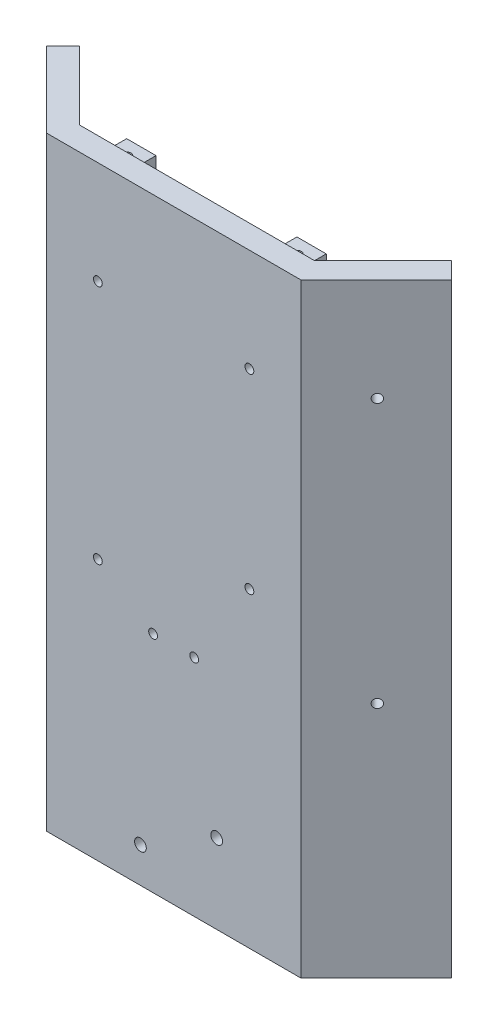
ISO-10303-21;
HEADER;
FILE_DESCRIPTION(('STEP AP214'),'2;1');
FILE_NAME('part.step','',(''),(''),'','','');
FILE_SCHEMA(('AUTOMOTIVE_DESIGN { 1 0 10303 214 1 1 1 1 }'));
ENDSEC;
DATA;
#1=APPLICATION_CONTEXT('core data for automotive mechanical design processes');
#2=APPLICATION_PROTOCOL_DEFINITION('international standard','automotive_design',2000,#1);
#3=PRODUCT_CONTEXT('',#1,'mechanical');
#4=PRODUCT('Part','Part','',(#3));
#5=PRODUCT_RELATED_PRODUCT_CATEGORY('part','',(#4));
#6=PRODUCT_DEFINITION_FORMATION('','',#4);
#7=PRODUCT_DEFINITION_CONTEXT('part definition',#1,'design');
#8=PRODUCT_DEFINITION('design','',#6,#7);
#9=PRODUCT_DEFINITION_SHAPE('','',#8);
#10=(LENGTH_UNIT() NAMED_UNIT(*) SI_UNIT(.MILLI.,.METRE.));
#11=(NAMED_UNIT(*) PLANE_ANGLE_UNIT() SI_UNIT($,.RADIAN.));
#12=(NAMED_UNIT(*) SI_UNIT($,.STERADIAN.) SOLID_ANGLE_UNIT());
#13=UNCERTAINTY_MEASURE_WITH_UNIT(LENGTH_MEASURE(1.E-05),#10,'distance_accuracy_value','');
#14=(GEOMETRIC_REPRESENTATION_CONTEXT(3) GLOBAL_UNCERTAINTY_ASSIGNED_CONTEXT((#13)) GLOBAL_UNIT_ASSIGNED_CONTEXT((#10,
#11,#12)) REPRESENTATION_CONTEXT('',''));
#15=CARTESIAN_POINT('',(0.,0.,0.));
#16=DIRECTION('',(0.,0.,1.));
#17=DIRECTION('',(1.,0.,0.));
#18=AXIS2_PLACEMENT_3D('',#15,#16,#17);
#19=CARTESIAN_POINT('',(-40.,206.,0.));
#20=DIRECTION('',(0.,0.,1.));
#21=DIRECTION('',(1.,0.,0.));
#22=AXIS2_PLACEMENT_3D('',#19,#20,#21);
#23=PLANE('',#22);
#24=CARTESIAN_POINT('',(-25.8137084989847,89.,0.));
#25=DIRECTION('',(0.,0.,1.));
#26=DIRECTION('',(1.,0.,0.));
#27=AXIS2_PLACEMENT_3D('',#24,#25,#26);
#28=CIRCLE('',#27,1.50000000000001);
#29=CARTESIAN_POINT('',(-24.3137084989847,89.,0.));
#30=VERTEX_POINT('',#29);
#31=EDGE_CURVE('E452',#30,#30,#28,.F.);
#32=ORIENTED_EDGE('',*,*,#31,.F.);
#33=EDGE_LOOP('',(#32));
#34=FACE_BOUND('',#33,.T.);
#35=CARTESIAN_POINT('',(25.8137084989848,106.,0.));
#36=DIRECTION('',(0.,0.,1.));
#37=DIRECTION('',(1.,0.,0.));
#38=AXIS2_PLACEMENT_3D('',#35,#36,#37);
#39=CIRCLE('',#38,1.5);
#40=CARTESIAN_POINT('',(27.3137084989848,106.,0.));
#41=VERTEX_POINT('',#40);
#42=EDGE_CURVE('E445',#41,#41,#39,.F.);
#43=ORIENTED_EDGE('',*,*,#42,.F.);
#44=EDGE_LOOP('',(#43));
#45=FACE_BOUND('',#44,.T.);
#46=CARTESIAN_POINT('',(-25.8137084989847,171.,0.));
#47=DIRECTION('',(0.,0.,1.));
#48=DIRECTION('',(1.,0.,0.));
#49=AXIS2_PLACEMENT_3D('',#46,#47,#48);
#50=CIRCLE('',#49,1.5);
#51=CARTESIAN_POINT('',(-24.3137084989847,171.,0.));
#52=VERTEX_POINT('',#51);
#53=EDGE_CURVE('E444',#52,#52,#50,.F.);
#54=ORIENTED_EDGE('',*,*,#53,.F.);
#55=EDGE_LOOP('',(#54));
#56=FACE_BOUND('',#55,.T.);
#57=CARTESIAN_POINT('',(25.8137084989848,171.,0.));
#58=DIRECTION('',(0.,0.,1.));
#59=DIRECTION('',(1.,0.,0.));
#60=AXIS2_PLACEMENT_3D('',#57,#58,#59);
#61=CIRCLE('',#60,1.50000000000001);
#62=CARTESIAN_POINT('',(27.3137084989848,171.,0.));
#63=VERTEX_POINT('',#62);
#64=EDGE_CURVE('E461',#63,#63,#61,.F.);
#65=ORIENTED_EDGE('',*,*,#64,.F.);
#66=EDGE_LOOP('',(#65));
#67=FACE_BOUND('',#66,.T.);
#68=CARTESIAN_POINT('',(-6.99999999999999,76.404082057735,0.));
#69=DIRECTION('',(0.,0.,1.));
#70=DIRECTION('',(1.,0.,0.));
#71=AXIS2_PLACEMENT_3D('',#68,#69,#70);
#72=CIRCLE('',#71,1.5);
#73=CARTESIAN_POINT('',(-5.49999999999999,76.404082057735,0.));
#74=VERTEX_POINT('',#73);
#75=EDGE_CURVE('E468',#74,#74,#72,.F.);
#76=ORIENTED_EDGE('',*,*,#75,.F.);
#77=EDGE_LOOP('',(#76));
#78=FACE_BOUND('',#77,.T.);
#79=CARTESIAN_POINT('',(7.00000000000001,76.404082057735,0.));
#80=DIRECTION('',(0.,0.,1.));
#81=DIRECTION('',(1.,0.,0.));
#82=AXIS2_PLACEMENT_3D('',#79,#80,#81);
#83=CIRCLE('',#82,1.5);
#84=CARTESIAN_POINT('',(8.50000000000002,76.404082057735,0.));
#85=VERTEX_POINT('',#84);
#86=EDGE_CURVE('E469',#85,#85,#83,.F.);
#87=ORIENTED_EDGE('',*,*,#86,.F.);
#88=EDGE_LOOP('',(#87));
#89=FACE_BOUND('',#88,.T.);
#90=CARTESIAN_POINT('',(-11.3137084989847,12.,0.));
#91=DIRECTION('',(0.,0.,1.));
#92=DIRECTION('',(1.,0.,0.));
#93=AXIS2_PLACEMENT_3D('',#90,#91,#92);
#94=CIRCLE('',#93,1.99999999999999);
#95=CARTESIAN_POINT('',(-9.31370849898474,12.,0.));
#96=VERTEX_POINT('',#95);
#97=EDGE_CURVE('E480',#96,#96,#94,.F.);
#98=ORIENTED_EDGE('',*,*,#97,.F.);
#99=EDGE_LOOP('',(#98));
#100=FACE_BOUND('',#99,.T.);
#101=CARTESIAN_POINT('',(14.6670536145485,26.9999999999999,0.));
#102=DIRECTION('',(0.,0.,1.));
#103=DIRECTION('',(1.,0.,0.));
#104=AXIS2_PLACEMENT_3D('',#101,#102,#103);
#105=CIRCLE('',#104,2.);
#106=CARTESIAN_POINT('',(16.6670536145485,26.9999999999999,0.));
#107=VERTEX_POINT('',#106);
#108=EDGE_CURVE('E481',#107,#107,#105,.F.);
#109=ORIENTED_EDGE('',*,*,#108,.F.);
#110=EDGE_LOOP('',(#109));
#111=FACE_BOUND('',#110,.T.);
#112=DIRECTION('',(0.,1.,0.));
#113=VECTOR('',#112,1.);
#114=CARTESIAN_POINT('',(24.,200.,0.));
#115=LINE('',#114,#113);
#116=CARTESIAN_POINT('',(24.,194.,0.));
#117=VERTEX_POINT('',#116);
#118=CARTESIAN_POINT('',(24.,200.,0.));
#119=VERTEX_POINT('',#118);
#120=EDGE_CURVE('E166',#117,#119,#115,.T.);
#121=ORIENTED_EDGE('',*,*,#120,.F.);
#122=DIRECTION('',(-1.,0.,0.));
#123=VECTOR('',#122,1.);
#124=CARTESIAN_POINT('',(34.,194.,0.));
#125=LINE('',#124,#123);
#126=CARTESIAN_POINT('',(34.,194.,0.));
#127=VERTEX_POINT('',#126);
#128=EDGE_CURVE('E179',#127,#117,#125,.T.);
#129=ORIENTED_EDGE('',*,*,#128,.F.);
#130=DIRECTION('',(0.,-1.,0.));
#131=VECTOR('',#130,1.);
#132=CARTESIAN_POINT('',(34.,200.,0.));
#133=LINE('',#132,#131);
#134=CARTESIAN_POINT('',(34.,200.,0.));
#135=VERTEX_POINT('',#134);
#136=EDGE_CURVE('E188',#135,#127,#133,.T.);
#137=ORIENTED_EDGE('',*,*,#136,.F.);
#138=DIRECTION('',(1.,0.,0.));
#139=VECTOR('',#138,1.);
#140=CARTESIAN_POINT('',(34.,200.,0.));
#141=LINE('',#140,#139);
#142=EDGE_CURVE('E169',#119,#135,#141,.T.);
#143=ORIENTED_EDGE('',*,*,#142,.F.);
#144=EDGE_LOOP('',(#121,#129,#137,#143));
#145=FACE_BOUND('',#144,.T.);
#146=DIRECTION('',(-1.,0.,0.));
#147=VECTOR('',#146,1.);
#148=CARTESIAN_POINT('',(-40.,0.,0.));
#149=LINE('',#148,#147);
#150=CARTESIAN_POINT('',(40.,0.,0.));
#151=VERTEX_POINT('',#150);
#152=CARTESIAN_POINT('',(-40.,0.,0.));
#153=VERTEX_POINT('',#152);
#154=EDGE_CURVE('E209',#151,#153,#149,.T.);
#155=ORIENTED_EDGE('',*,*,#154,.T.);
#156=DIRECTION('',(0.,-1.,0.));
#157=VECTOR('',#156,1.);
#158=CARTESIAN_POINT('',(-40.,206.,0.));
#159=LINE('',#158,#157);
#160=CARTESIAN_POINT('',(-40.,206.,0.));
#161=VERTEX_POINT('',#160);
#162=EDGE_CURVE('E223',#161,#153,#159,.T.);
#163=ORIENTED_EDGE('',*,*,#162,.F.);
#164=DIRECTION('',(-1.,0.,0.));
#165=VECTOR('',#164,1.);
#166=CARTESIAN_POINT('',(-40.,206.,0.));
#167=LINE('',#166,#165);
#168=CARTESIAN_POINT('',(40.,206.,0.));
#169=VERTEX_POINT('',#168);
#170=EDGE_CURVE('E221',#169,#161,#167,.T.);
#171=ORIENTED_EDGE('',*,*,#170,.F.);
#172=DIRECTION('',(0.,-1.,0.));
#173=VECTOR('',#172,1.);
#174=CARTESIAN_POINT('',(40.,206.,0.));
#175=LINE('',#174,#173);
#176=EDGE_CURVE('E241',#169,#151,#175,.T.);
#177=ORIENTED_EDGE('',*,*,#176,.T.);
#178=EDGE_LOOP('',(#155,#163,#171,#177));
#179=FACE_BOUND('',#178,.T.);
#180=DIRECTION('',(0.,1.,0.));
#181=VECTOR('',#180,1.);
#182=CARTESIAN_POINT('',(-34.,200.,0.));
#183=LINE('',#182,#181);
#184=CARTESIAN_POINT('',(-34.,194.,0.));
#185=VERTEX_POINT('',#184);
#186=CARTESIAN_POINT('',(-34.,200.,0.));
#187=VERTEX_POINT('',#186);
#188=EDGE_CURVE('E165',#185,#187,#183,.T.);
#189=ORIENTED_EDGE('',*,*,#188,.F.);
#190=DIRECTION('',(-1.,0.,0.));
#191=VECTOR('',#190,1.);
#192=CARTESIAN_POINT('',(-24.,194.,0.));
#193=LINE('',#192,#191);
#194=CARTESIAN_POINT('',(-24.,194.,0.));
#195=VERTEX_POINT('',#194);
#196=EDGE_CURVE('E162',#195,#185,#193,.T.);
#197=ORIENTED_EDGE('',*,*,#196,.F.);
#198=DIRECTION('',(0.,-1.,0.));
#199=VECTOR('',#198,1.);
#200=CARTESIAN_POINT('',(-24.,200.,0.));
#201=LINE('',#200,#199);
#202=CARTESIAN_POINT('',(-24.,200.,0.));
#203=VERTEX_POINT('',#202);
#204=EDGE_CURVE('E52',#203,#195,#201,.T.);
#205=ORIENTED_EDGE('',*,*,#204,.F.);
#206=DIRECTION('',(1.,0.,0.));
#207=VECTOR('',#206,1.);
#208=CARTESIAN_POINT('',(-24.,200.,0.));
#209=LINE('',#208,#207);
#210=EDGE_CURVE('E47',#187,#203,#209,.T.);
#211=ORIENTED_EDGE('',*,*,#210,.F.);
#212=EDGE_LOOP('',(#189,#197,#205,#211));
#213=FACE_BOUND('',#212,.T.);
#214=ADVANCED_FACE('F32',(#34,#45,#56,#67,#78,#89,#100,#111,#145,#179,#213),#23,.F.);
#215=CARTESIAN_POINT('',(-40.,206.,0.));
#216=DIRECTION('',(-0.707106781186544,0.,0.707106781186551));
#217=DIRECTION('',(0.707106781186551,0.,0.707106781186544));
#218=AXIS2_PLACEMENT_3D('',#215,#216,#217);
#219=PLANE('',#218);
#220=CARTESIAN_POINT('',(-48.5559920523573,171.,-8.55599205235717));
#221=DIRECTION('',(-0.707106781186544,0.,0.707106781186551));
#222=DIRECTION('',(0.707106781186551,0.,0.707106781186544));
#223=AXIS2_PLACEMENT_3D('',#220,#221,#222);
#224=CIRCLE('',#223,1.5);
#225=CARTESIAN_POINT('',(-47.4953318805774,171.,-7.49533188057736));
#226=VERTEX_POINT('',#225);
#227=EDGE_CURVE('E418',#226,#226,#224,.F.);
#228=ORIENTED_EDGE('',*,*,#227,.F.);
#229=EDGE_LOOP('',(#228));
#230=FACE_BOUND('',#229,.T.);
#231=CARTESIAN_POINT('',(-48.5559920523573,76.,-8.55599205235717));
#232=DIRECTION('',(-0.707106781186544,0.,0.707106781186551));
#233=DIRECTION('',(0.707106781186551,0.,0.707106781186544));
#234=AXIS2_PLACEMENT_3D('',#231,#232,#233);
#235=CIRCLE('',#234,1.5);
#236=CARTESIAN_POINT('',(-47.4953318805774,76.,-7.49533188057736));
#237=VERTEX_POINT('',#236);
#238=EDGE_CURVE('E424',#237,#237,#235,.F.);
#239=ORIENTED_EDGE('',*,*,#238,.F.);
#240=EDGE_LOOP('',(#239));
#241=FACE_BOUND('',#240,.T.);
#242=DIRECTION('',(-0.707106781186551,0.,-0.707106781186544));
#243=VECTOR('',#242,1.);
#244=CARTESIAN_POINT('',(-40.,0.,0.));
#245=LINE('',#244,#243);
#246=CARTESIAN_POINT('',(-63.3345237791562,0.,-23.334523779156));
#247=VERTEX_POINT('',#246);
#248=EDGE_CURVE('E204',#153,#247,#245,.T.);
#249=ORIENTED_EDGE('',*,*,#248,.T.);
#250=DIRECTION('',(0.,-1.,0.));
#251=VECTOR('',#250,1.);
#252=CARTESIAN_POINT('',(-63.3345237791562,206.,-23.334523779156));
#253=LINE('',#252,#251);
#254=CARTESIAN_POINT('',(-63.3345237791562,206.,-23.334523779156));
#255=VERTEX_POINT('',#254);
#256=EDGE_CURVE('E11',#255,#247,#253,.T.);
#257=ORIENTED_EDGE('',*,*,#256,.F.);
#258=DIRECTION('',(-0.707106781186551,0.,-0.707106781186544));
#259=VECTOR('',#258,1.);
#260=CARTESIAN_POINT('',(-40.,206.,0.));
#261=LINE('',#260,#259);
#262=EDGE_CURVE('E205',#161,#255,#261,.T.);
#263=ORIENTED_EDGE('',*,*,#262,.F.);
#264=ORIENTED_EDGE('',*,*,#162,.T.);
#265=EDGE_LOOP('',(#249,#257,#263,#264));
#266=FACE_BOUND('',#265,.T.);
#267=ADVANCED_FACE('F34',(#230,#241,#266),#219,.F.);
#268=CARTESIAN_POINT('',(-68.9913780286485,206.,-17.6776695296635));
#269=DIRECTION('',(0.707106781186551,0.,0.707106781186544));
#270=DIRECTION('',(0.707106781186544,0.,-0.707106781186551));
#271=AXIS2_PLACEMENT_3D('',#268,#269,#270);
#272=PLANE('',#271);
#273=DIRECTION('',(-0.707106781186544,0.,0.707106781186551));
#274=VECTOR('',#273,1.);
#275=CARTESIAN_POINT('',(-68.9913780286485,0.,-17.6776695296635));
#276=LINE('',#275,#274);
#277=CARTESIAN_POINT('',(-68.9913780286485,0.,-17.6776695296635));
#278=VERTEX_POINT('',#277);
#279=EDGE_CURVE('E226',#247,#278,#276,.T.);
#280=ORIENTED_EDGE('',*,*,#279,.T.);
#281=DIRECTION('',(0.,-1.,0.));
#282=VECTOR('',#281,1.);
#283=CARTESIAN_POINT('',(-68.9913780286485,206.,-17.6776695296635));
#284=LINE('',#283,#282);
#285=CARTESIAN_POINT('',(-68.9913780286485,206.,-17.6776695296635));
#286=VERTEX_POINT('',#285);
#287=EDGE_CURVE('E40',#286,#278,#284,.T.);
#288=ORIENTED_EDGE('',*,*,#287,.F.);
#289=DIRECTION('',(-0.707106781186544,0.,0.707106781186551));
#290=VECTOR('',#289,1.);
#291=CARTESIAN_POINT('',(-68.9913780286485,206.,-17.6776695296635));
#292=LINE('',#291,#290);
#293=EDGE_CURVE('E208',#255,#286,#292,.T.);
#294=ORIENTED_EDGE('',*,*,#293,.F.);
#295=ORIENTED_EDGE('',*,*,#256,.T.);
#296=EDGE_LOOP('',(#280,#288,#294,#295));
#297=FACE_BOUND('',#296,.T.);
#298=ADVANCED_FACE('F283',(#297),#272,.F.);
#299=CARTESIAN_POINT('',(-43.3137084989847,206.,8.));
#300=DIRECTION('',(0.707106781186544,0.,-0.707106781186551));
#301=DIRECTION('',(-0.707106781186551,0.,-0.707106781186544));
#302=AXIS2_PLACEMENT_3D('',#299,#300,#301);
#303=PLANE('',#302);
#304=CARTESIAN_POINT('',(-54.2128463018496,171.,-2.89913780286477));
#305=DIRECTION('',(-0.707106781186544,0.,0.707106781186551));
#306=DIRECTION('',(0.707106781186551,0.,0.707106781186544));
#307=AXIS2_PLACEMENT_3D('',#304,#305,#306);
#308=CIRCLE('',#307,1.5);
#309=CARTESIAN_POINT('',(-53.1521861300698,171.,-1.83847763108495));
#310=VERTEX_POINT('',#309);
#311=EDGE_CURVE('E415',#310,#310,#308,.T.);
#312=ORIENTED_EDGE('',*,*,#311,.F.);
#313=EDGE_LOOP('',(#312));
#314=FACE_BOUND('',#313,.T.);
#315=CARTESIAN_POINT('',(-54.2128463018496,76.,-2.89913780286477));
#316=DIRECTION('',(-0.707106781186544,0.,0.707106781186551));
#317=DIRECTION('',(0.707106781186551,0.,0.707106781186544));
#318=AXIS2_PLACEMENT_3D('',#315,#316,#317);
#319=CIRCLE('',#318,1.5);
#320=CARTESIAN_POINT('',(-53.1521861300698,76.,-1.83847763108495));
#321=VERTEX_POINT('',#320);
#322=EDGE_CURVE('E427',#321,#321,#319,.T.);
#323=ORIENTED_EDGE('',*,*,#322,.F.);
#324=EDGE_LOOP('',(#323));
#325=FACE_BOUND('',#324,.T.);
#326=DIRECTION('',(0.707106781186551,0.,0.707106781186544));
#327=VECTOR('',#326,1.);
#328=CARTESIAN_POINT('',(-43.3137084989847,0.,8.));
#329=LINE('',#328,#327);
#330=CARTESIAN_POINT('',(-43.3137084989847,0.,8.));
#331=VERTEX_POINT('',#330);
#332=EDGE_CURVE('E228',#278,#331,#329,.T.);
#333=ORIENTED_EDGE('',*,*,#332,.T.);
#334=DIRECTION('',(0.,-1.,0.));
#335=VECTOR('',#334,1.);
#336=CARTESIAN_POINT('',(-43.3137084989847,206.,8.));
#337=LINE('',#336,#335);
#338=CARTESIAN_POINT('',(-43.3137084989847,206.,8.));
#339=VERTEX_POINT('',#338);
#340=EDGE_CURVE('E253',#339,#331,#337,.T.);
#341=ORIENTED_EDGE('',*,*,#340,.F.);
#342=DIRECTION('',(0.707106781186551,0.,0.707106781186544));
#343=VECTOR('',#342,1.);
#344=CARTESIAN_POINT('',(-43.3137084989847,206.,8.));
#345=LINE('',#344,#343);
#346=EDGE_CURVE('E211',#286,#339,#345,.T.);
#347=ORIENTED_EDGE('',*,*,#346,.F.);
#348=ORIENTED_EDGE('',*,*,#287,.T.);
#349=EDGE_LOOP('',(#333,#341,#347,#348));
#350=FACE_BOUND('',#349,.T.);
#351=ADVANCED_FACE('F260',(#314,#325,#350),#303,.F.);
#352=CARTESIAN_POINT('',(-43.3137084989847,206.,8.));
#353=DIRECTION('',(0.,0.,-1.));
#354=DIRECTION('',(-1.,0.,0.));
#355=AXIS2_PLACEMENT_3D('',#352,#353,#354);
#356=PLANE('',#355);
#357=CARTESIAN_POINT('',(-25.8137084989847,89.,8.));
#358=DIRECTION('',(0.,0.,1.));
#359=DIRECTION('',(1.,0.,0.));
#360=AXIS2_PLACEMENT_3D('',#357,#358,#359);
#361=CIRCLE('',#360,1.50000000000001);
#362=CARTESIAN_POINT('',(-24.3137084989847,89.,8.));
#363=VERTEX_POINT('',#362);
#364=EDGE_CURVE('E440',#363,#363,#361,.T.);
#365=ORIENTED_EDGE('',*,*,#364,.F.);
#366=EDGE_LOOP('',(#365));
#367=FACE_BOUND('',#366,.T.);
#368=CARTESIAN_POINT('',(25.8137084989848,106.,8.));
#369=DIRECTION('',(0.,0.,1.));
#370=DIRECTION('',(1.,0.,0.));
#371=AXIS2_PLACEMENT_3D('',#368,#369,#370);
#372=CIRCLE('',#371,1.5);
#373=CARTESIAN_POINT('',(27.3137084989848,106.,8.));
#374=VERTEX_POINT('',#373);
#375=EDGE_CURVE('E449',#374,#374,#372,.T.);
#376=ORIENTED_EDGE('',*,*,#375,.F.);
#377=EDGE_LOOP('',(#376));
#378=FACE_BOUND('',#377,.T.);
#379=CARTESIAN_POINT('',(-25.8137084989847,171.,8.));
#380=DIRECTION('',(0.,0.,1.));
#381=DIRECTION('',(1.,0.,0.));
#382=AXIS2_PLACEMENT_3D('',#379,#380,#381);
#383=CIRCLE('',#382,1.5);
#384=CARTESIAN_POINT('',(-24.3137084989847,171.,8.));
#385=VERTEX_POINT('',#384);
#386=EDGE_CURVE('E441',#385,#385,#383,.T.);
#387=ORIENTED_EDGE('',*,*,#386,.F.);
#388=EDGE_LOOP('',(#387));
#389=FACE_BOUND('',#388,.T.);
#390=CARTESIAN_POINT('',(25.8137084989848,171.,8.));
#391=DIRECTION('',(0.,0.,1.));
#392=DIRECTION('',(1.,0.,0.));
#393=AXIS2_PLACEMENT_3D('',#390,#391,#392);
#394=CIRCLE('',#393,1.50000000000001);
#395=CARTESIAN_POINT('',(27.3137084989848,171.,8.));
#396=VERTEX_POINT('',#395);
#397=EDGE_CURVE('E448',#396,#396,#394,.T.);
#398=ORIENTED_EDGE('',*,*,#397,.F.);
#399=EDGE_LOOP('',(#398));
#400=FACE_BOUND('',#399,.T.);
#401=CARTESIAN_POINT('',(-6.99999999999999,76.404082057735,8.));
#402=DIRECTION('',(0.,0.,1.));
#403=DIRECTION('',(1.,0.,0.));
#404=AXIS2_PLACEMENT_3D('',#401,#402,#403);
#405=CIRCLE('',#404,1.5);
#406=CARTESIAN_POINT('',(-5.49999999999999,76.404082057735,8.));
#407=VERTEX_POINT('',#406);
#408=EDGE_CURVE('E465',#407,#407,#405,.T.);
#409=ORIENTED_EDGE('',*,*,#408,.F.);
#410=EDGE_LOOP('',(#409));
#411=FACE_BOUND('',#410,.T.);
#412=CARTESIAN_POINT('',(7.00000000000001,76.404082057735,8.));
#413=DIRECTION('',(0.,0.,1.));
#414=DIRECTION('',(1.,0.,0.));
#415=AXIS2_PLACEMENT_3D('',#412,#413,#414);
#416=CIRCLE('',#415,1.5);
#417=CARTESIAN_POINT('',(8.50000000000002,76.404082057735,8.));
#418=VERTEX_POINT('',#417);
#419=EDGE_CURVE('E464',#418,#418,#416,.T.);
#420=ORIENTED_EDGE('',*,*,#419,.F.);
#421=EDGE_LOOP('',(#420));
#422=FACE_BOUND('',#421,.T.);
#423=CARTESIAN_POINT('',(-11.3137084989847,12.,8.));
#424=DIRECTION('',(0.,0.,1.));
#425=DIRECTION('',(1.,0.,0.));
#426=AXIS2_PLACEMENT_3D('',#423,#424,#425);
#427=CIRCLE('',#426,1.99999999999999);
#428=CARTESIAN_POINT('',(-9.31370849898474,12.,8.));
#429=VERTEX_POINT('',#428);
#430=EDGE_CURVE('E477',#429,#429,#427,.T.);
#431=ORIENTED_EDGE('',*,*,#430,.F.);
#432=EDGE_LOOP('',(#431));
#433=FACE_BOUND('',#432,.T.);
#434=CARTESIAN_POINT('',(14.6670536145485,26.9999999999999,8.));
#435=DIRECTION('',(0.,0.,1.));
#436=DIRECTION('',(1.,0.,0.));
#437=AXIS2_PLACEMENT_3D('',#434,#435,#436);
#438=CIRCLE('',#437,2.);
#439=CARTESIAN_POINT('',(16.6670536145485,26.9999999999999,8.));
#440=VERTEX_POINT('',#439);
#441=EDGE_CURVE('E472',#440,#440,#438,.T.);
#442=ORIENTED_EDGE('',*,*,#441,.F.);
#443=EDGE_LOOP('',(#442));
#444=FACE_BOUND('',#443,.T.);
#445=DIRECTION('',(1.,0.,0.));
#446=VECTOR('',#445,1.);
#447=CARTESIAN_POINT('',(-43.3137084989847,0.,8.));
#448=LINE('',#447,#446);
#449=CARTESIAN_POINT('',(43.3137084989848,0.,8.));
#450=VERTEX_POINT('',#449);
#451=EDGE_CURVE('E230',#331,#450,#448,.T.);
#452=ORIENTED_EDGE('',*,*,#451,.T.);
#453=DIRECTION('',(0.,-1.,0.));
#454=VECTOR('',#453,1.);
#455=CARTESIAN_POINT('',(43.3137084989848,206.,8.));
#456=LINE('',#455,#454);
#457=CARTESIAN_POINT('',(43.3137084989848,206.,8.));
#458=VERTEX_POINT('',#457);
#459=EDGE_CURVE('E250',#458,#450,#456,.T.);
#460=ORIENTED_EDGE('',*,*,#459,.F.);
#461=DIRECTION('',(1.,0.,0.));
#462=VECTOR('',#461,1.);
#463=CARTESIAN_POINT('',(-43.3137084989847,206.,8.));
#464=LINE('',#463,#462);
#465=EDGE_CURVE('E213',#339,#458,#464,.T.);
#466=ORIENTED_EDGE('',*,*,#465,.F.);
#467=ORIENTED_EDGE('',*,*,#340,.T.);
#468=EDGE_LOOP('',(#452,#460,#466,#467));
#469=FACE_BOUND('',#468,.T.);
#470=ADVANCED_FACE('F271',(#367,#378,#389,#400,#411,#422,#433,#444,#469),#356,.F.);
#471=CARTESIAN_POINT('',(43.3137084989848,206.,8.));
#472=DIRECTION('',(-0.707106781186549,0.,-0.707106781186546));
#473=DIRECTION('',(-0.707106781186546,0.,0.707106781186549));
#474=AXIS2_PLACEMENT_3D('',#471,#472,#473);
#475=PLANE('',#474);
#476=CARTESIAN_POINT('',(56.3527575440647,171.,-5.03904904507995));
#477=DIRECTION('',(-0.707106781186549,0.,-0.707106781186546));
#478=DIRECTION('',(-0.707106781186546,0.,0.707106781186549));
#479=AXIS2_PLACEMENT_3D('',#476,#477,#478);
#480=CIRCLE('',#479,1.5);
#481=CARTESIAN_POINT('',(55.2920973722849,171.,-3.97838887330013));
#482=VERTEX_POINT('',#481);
#483=EDGE_CURVE('E437',#482,#482,#480,.F.);
#484=ORIENTED_EDGE('',*,*,#483,.F.);
#485=EDGE_LOOP('',(#484));
#486=FACE_BOUND('',#485,.T.);
#487=CARTESIAN_POINT('',(56.3527575440647,81.,-5.03904904507995));
#488=DIRECTION('',(-0.707106781186549,0.,-0.707106781186546));
#489=DIRECTION('',(-0.707106781186546,0.,0.707106781186549));
#490=AXIS2_PLACEMENT_3D('',#487,#488,#489);
#491=CIRCLE('',#490,1.5);
#492=CARTESIAN_POINT('',(55.2920973722849,81.,-3.97838887330013));
#493=VERTEX_POINT('',#492);
#494=EDGE_CURVE('E433',#493,#493,#491,.F.);
#495=ORIENTED_EDGE('',*,*,#494,.F.);
#496=EDGE_LOOP('',(#495));
#497=FACE_BOUND('',#496,.T.);
#498=DIRECTION('',(0.707106781186546,0.,-0.707106781186549));
#499=VECTOR('',#498,1.);
#500=CARTESIAN_POINT('',(43.3137084989848,0.,8.));
#501=LINE('',#500,#499);
#502=CARTESIAN_POINT('',(68.9913780286484,0.,-17.6776695296637));
#503=VERTEX_POINT('',#502);
#504=EDGE_CURVE('E232',#450,#503,#501,.T.);
#505=ORIENTED_EDGE('',*,*,#504,.T.);
#506=DIRECTION('',(0.,-1.,0.));
#507=VECTOR('',#506,1.);
#508=CARTESIAN_POINT('',(68.9913780286484,206.,-17.6776695296637));
#509=LINE('',#508,#507);
#510=CARTESIAN_POINT('',(68.9913780286484,206.,-17.6776695296637));
#511=VERTEX_POINT('',#510);
#512=EDGE_CURVE('E247',#511,#503,#509,.T.);
#513=ORIENTED_EDGE('',*,*,#512,.F.);
#514=DIRECTION('',(0.707106781186546,0.,-0.707106781186549));
#515=VECTOR('',#514,1.);
#516=CARTESIAN_POINT('',(43.3137084989848,206.,8.));
#517=LINE('',#516,#515);
#518=EDGE_CURVE('E215',#458,#511,#517,.T.);
#519=ORIENTED_EDGE('',*,*,#518,.F.);
#520=ORIENTED_EDGE('',*,*,#459,.T.);
#521=EDGE_LOOP('',(#505,#513,#519,#520));
#522=FACE_BOUND('',#521,.T.);
#523=ADVANCED_FACE('F275',(#486,#497,#522),#475,.F.);
#524=CARTESIAN_POINT('',(68.9913780286484,206.,-17.6776695296637));
#525=DIRECTION('',(-0.707106781186546,0.,0.707106781186549));
#526=DIRECTION('',(0.707106781186549,0.,0.707106781186546));
#527=AXIS2_PLACEMENT_3D('',#524,#525,#526);
#528=PLANE('',#527);
#529=DIRECTION('',(-0.707106781186549,0.,-0.707106781186546));
#530=VECTOR('',#529,1.);
#531=CARTESIAN_POINT('',(68.9913780286484,0.,-17.6776695296637));
#532=LINE('',#531,#530);
#533=CARTESIAN_POINT('',(63.334523779156,0.,-23.3345237791561));
#534=VERTEX_POINT('',#533);
#535=EDGE_CURVE('E234',#503,#534,#532,.T.);
#536=ORIENTED_EDGE('',*,*,#535,.T.);
#537=DIRECTION('',(0.,-1.,0.));
#538=VECTOR('',#537,1.);
#539=CARTESIAN_POINT('',(63.334523779156,206.,-23.3345237791561));
#540=LINE('',#539,#538);
#541=CARTESIAN_POINT('',(63.334523779156,206.,-23.3345237791561));
#542=VERTEX_POINT('',#541);
#543=EDGE_CURVE('E244',#542,#534,#540,.T.);
#544=ORIENTED_EDGE('',*,*,#543,.F.);
#545=DIRECTION('',(-0.707106781186549,0.,-0.707106781186546));
#546=VECTOR('',#545,1.);
#547=CARTESIAN_POINT('',(68.9913780286484,206.,-17.6776695296637));
#548=LINE('',#547,#546);
#549=EDGE_CURVE('E217',#511,#542,#548,.T.);
#550=ORIENTED_EDGE('',*,*,#549,.F.);
#551=ORIENTED_EDGE('',*,*,#512,.T.);
#552=EDGE_LOOP('',(#536,#544,#550,#551));
#553=FACE_BOUND('',#552,.T.);
#554=ADVANCED_FACE('F295',(#553),#528,.F.);
#555=CARTESIAN_POINT('',(40.,206.,0.));
#556=DIRECTION('',(0.707106781186549,0.,0.707106781186546));
#557=DIRECTION('',(0.707106781186546,0.,-0.707106781186549));
#558=AXIS2_PLACEMENT_3D('',#555,#556,#557);
#559=PLANE('',#558);
#560=CARTESIAN_POINT('',(50.6959032945723,171.,-10.6959032945723));
#561=DIRECTION('',(0.707106781186549,0.,0.707106781186546));
#562=DIRECTION('',(0.707106781186546,0.,-0.707106781186549));
#563=AXIS2_PLACEMENT_3D('',#560,#561,#562);
#564=CIRCLE('',#563,1.5);
#565=CARTESIAN_POINT('',(51.7565634663521,171.,-11.7565634663522));
#566=VERTEX_POINT('',#565);
#567=EDGE_CURVE('E422',#566,#566,#564,.F.);
#568=ORIENTED_EDGE('',*,*,#567,.F.);
#569=EDGE_LOOP('',(#568));
#570=FACE_BOUND('',#569,.T.);
#571=CARTESIAN_POINT('',(50.6959032945723,81.,-10.6959032945723));
#572=DIRECTION('',(0.707106781186549,0.,0.707106781186546));
#573=DIRECTION('',(0.707106781186546,0.,-0.707106781186549));
#574=AXIS2_PLACEMENT_3D('',#571,#572,#573);
#575=CIRCLE('',#574,1.5);
#576=CARTESIAN_POINT('',(51.7565634663521,81.,-11.7565634663522));
#577=VERTEX_POINT('',#576);
#578=EDGE_CURVE('E419',#577,#577,#575,.F.);
#579=ORIENTED_EDGE('',*,*,#578,.F.);
#580=EDGE_LOOP('',(#579));
#581=FACE_BOUND('',#580,.T.);
#582=DIRECTION('',(-0.707106781186546,0.,0.707106781186549));
#583=VECTOR('',#582,1.);
#584=CARTESIAN_POINT('',(40.,0.,0.));
#585=LINE('',#584,#583);
#586=EDGE_CURVE('E236',#534,#151,#585,.T.);
#587=ORIENTED_EDGE('',*,*,#586,.T.);
#588=ORIENTED_EDGE('',*,*,#176,.F.);
#589=DIRECTION('',(-0.707106781186546,0.,0.707106781186549));
#590=VECTOR('',#589,1.);
#591=CARTESIAN_POINT('',(40.,206.,0.));
#592=LINE('',#591,#590);
#593=EDGE_CURVE('E219',#542,#169,#592,.T.);
#594=ORIENTED_EDGE('',*,*,#593,.F.);
#595=ORIENTED_EDGE('',*,*,#543,.T.);
#596=EDGE_LOOP('',(#587,#588,#594,#595));
#597=FACE_BOUND('',#596,.T.);
#598=ADVANCED_FACE('F293',(#570,#581,#597),#559,.F.);
#599=CARTESIAN_POINT('',(0.,206.,0.));
#600=DIRECTION('',(0.,-1.,0.));
#601=DIRECTION('',(0.,0.,-1.));
#602=AXIS2_PLACEMENT_3D('',#599,#600,#601);
#603=PLANE('',#602);
#604=ORIENTED_EDGE('',*,*,#262,.T.);
#605=ORIENTED_EDGE('',*,*,#293,.T.);
#606=ORIENTED_EDGE('',*,*,#346,.T.);
#607=ORIENTED_EDGE('',*,*,#465,.T.);
#608=ORIENTED_EDGE('',*,*,#518,.T.);
#609=ORIENTED_EDGE('',*,*,#549,.T.);
#610=ORIENTED_EDGE('',*,*,#593,.T.);
#611=ORIENTED_EDGE('',*,*,#170,.T.);
#612=EDGE_LOOP('',(#604,#605,#606,#607,#608,#609,#610,#611));
#613=FACE_BOUND('',#612,.T.);
#614=ADVANCED_FACE('F279',(#613),#603,.F.);
#615=CARTESIAN_POINT('',(0.,0.,0.));
#616=DIRECTION('',(0.,-1.,0.));
#617=DIRECTION('',(0.,0.,-1.));
#618=AXIS2_PLACEMENT_3D('',#615,#616,#617);
#619=PLANE('',#618);
#620=ORIENTED_EDGE('',*,*,#248,.F.);
#621=ORIENTED_EDGE('',*,*,#154,.F.);
#622=ORIENTED_EDGE('',*,*,#586,.F.);
#623=ORIENTED_EDGE('',*,*,#535,.F.);
#624=ORIENTED_EDGE('',*,*,#504,.F.);
#625=ORIENTED_EDGE('',*,*,#451,.F.);
#626=ORIENTED_EDGE('',*,*,#332,.F.);
#627=ORIENTED_EDGE('',*,*,#279,.F.);
#628=EDGE_LOOP('',(#620,#621,#622,#623,#624,#625,#626,#627));
#629=FACE_BOUND('',#628,.T.);
#630=ADVANCED_FACE('F266',(#629),#619,.T.);
#631=CARTESIAN_POINT('',(24.,200.,-10.));
#632=DIRECTION('',(1.,0.,0.));
#633=DIRECTION('',(0.,0.,-1.));
#634=AXIS2_PLACEMENT_3D('',#631,#632,#633);
#635=PLANE('',#634);
#636=ORIENTED_EDGE('',*,*,#120,.T.);
#637=DIRECTION('',(0.,0.,1.));
#638=VECTOR('',#637,1.);
#639=CARTESIAN_POINT('',(24.,200.,-10.));
#640=LINE('',#639,#638);
#641=CARTESIAN_POINT('',(24.,200.,-10.));
#642=VERTEX_POINT('',#641);
#643=EDGE_CURVE('E201',#642,#119,#640,.T.);
#644=ORIENTED_EDGE('',*,*,#643,.F.);
#645=DIRECTION('',(0.,1.,0.));
#646=VECTOR('',#645,1.);
#647=CARTESIAN_POINT('',(24.,200.,-10.));
#648=LINE('',#647,#646);
#649=CARTESIAN_POINT('',(24.,194.,-10.));
#650=VERTEX_POINT('',#649);
#651=EDGE_CURVE('E175',#650,#642,#648,.T.);
#652=ORIENTED_EDGE('',*,*,#651,.F.);
#653=DIRECTION('',(0.,0.,1.));
#654=VECTOR('',#653,1.);
#655=CARTESIAN_POINT('',(24.,194.,-10.));
#656=LINE('',#655,#654);
#657=EDGE_CURVE('E184',#650,#117,#656,.T.);
#658=ORIENTED_EDGE('',*,*,#657,.T.);
#659=EDGE_LOOP('',(#636,#644,#652,#658));
#660=FACE_BOUND('',#659,.T.);
#661=ADVANCED_FACE('F318',(#660),#635,.F.);
#662=CARTESIAN_POINT('',(34.,200.,-10.));
#663=DIRECTION('',(0.,-1.,0.));
#664=DIRECTION('',(1.,0.,0.));
#665=AXIS2_PLACEMENT_3D('',#662,#663,#664);
#666=PLANE('',#665);
#667=CARTESIAN_POINT('',(29.,200.,-5.));
#668=DIRECTION('',(0.,1.,0.));
#669=DIRECTION('',(-1.,0.,0.));
#670=AXIS2_PLACEMENT_3D('',#667,#668,#669);
#671=CIRCLE('',#670,1.50000000000001);
#672=CARTESIAN_POINT('',(27.5,200.,-5.));
#673=VERTEX_POINT('',#672);
#674=EDGE_CURVE('E484',#673,#673,#671,.T.);
#675=ORIENTED_EDGE('',*,*,#674,.F.);
#676=EDGE_LOOP('',(#675));
#677=FACE_BOUND('',#676,.T.);
#678=ORIENTED_EDGE('',*,*,#142,.T.);
#679=DIRECTION('',(0.,0.,1.));
#680=VECTOR('',#679,1.);
#681=CARTESIAN_POINT('',(34.,200.,-10.));
#682=LINE('',#681,#680);
#683=CARTESIAN_POINT('',(34.,200.,-10.));
#684=VERTEX_POINT('',#683);
#685=EDGE_CURVE('E198',#684,#135,#682,.T.);
#686=ORIENTED_EDGE('',*,*,#685,.F.);
#687=DIRECTION('',(1.,0.,0.));
#688=VECTOR('',#687,1.);
#689=CARTESIAN_POINT('',(34.,200.,-10.));
#690=LINE('',#689,#688);
#691=EDGE_CURVE('E178',#642,#684,#690,.T.);
#692=ORIENTED_EDGE('',*,*,#691,.F.);
#693=ORIENTED_EDGE('',*,*,#643,.T.);
#694=EDGE_LOOP('',(#678,#686,#692,#693));
#695=FACE_BOUND('',#694,.T.);
#696=ADVANCED_FACE('F323',(#677,#695),#666,.F.);
#697=CARTESIAN_POINT('',(34.,200.,-10.));
#698=DIRECTION('',(-1.,0.,0.));
#699=DIRECTION('',(0.,0.,1.));
#700=AXIS2_PLACEMENT_3D('',#697,#698,#699);
#701=PLANE('',#700);
#702=ORIENTED_EDGE('',*,*,#136,.T.);
#703=DIRECTION('',(0.,0.,1.));
#704=VECTOR('',#703,1.);
#705=CARTESIAN_POINT('',(34.,194.,-10.));
#706=LINE('',#705,#704);
#707=CARTESIAN_POINT('',(34.,194.,-10.));
#708=VERTEX_POINT('',#707);
#709=EDGE_CURVE('E195',#708,#127,#706,.T.);
#710=ORIENTED_EDGE('',*,*,#709,.F.);
#711=DIRECTION('',(0.,-1.,0.));
#712=VECTOR('',#711,1.);
#713=CARTESIAN_POINT('',(34.,200.,-10.));
#714=LINE('',#713,#712);
#715=EDGE_CURVE('E181',#684,#708,#714,.T.);
#716=ORIENTED_EDGE('',*,*,#715,.F.);
#717=ORIENTED_EDGE('',*,*,#685,.T.);
#718=EDGE_LOOP('',(#702,#710,#716,#717));
#719=FACE_BOUND('',#718,.T.);
#720=ADVANCED_FACE('F327',(#719),#701,.F.);
#721=CARTESIAN_POINT('',(34.,194.,-10.));
#722=DIRECTION('',(0.,1.,0.));
#723=DIRECTION('',(0.,0.,1.));
#724=AXIS2_PLACEMENT_3D('',#721,#722,#723);
#725=PLANE('',#724);
#726=CARTESIAN_POINT('',(29.,194.,-5.));
#727=DIRECTION('',(0.,1.,0.));
#728=DIRECTION('',(0.,0.,1.));
#729=AXIS2_PLACEMENT_3D('',#726,#727,#728);
#730=CIRCLE('',#729,1.50000000000001);
#731=CARTESIAN_POINT('',(29.,194.,-3.49999999999999));
#732=VERTEX_POINT('',#731);
#733=EDGE_CURVE('E493',#732,#732,#730,.F.);
#734=ORIENTED_EDGE('',*,*,#733,.F.);
#735=EDGE_LOOP('',(#734));
#736=FACE_BOUND('',#735,.T.);
#737=ORIENTED_EDGE('',*,*,#128,.T.);
#738=ORIENTED_EDGE('',*,*,#657,.F.);
#739=DIRECTION('',(-1.,0.,0.));
#740=VECTOR('',#739,1.);
#741=CARTESIAN_POINT('',(34.,194.,-10.));
#742=LINE('',#741,#740);
#743=EDGE_CURVE('E183',#708,#650,#742,.T.);
#744=ORIENTED_EDGE('',*,*,#743,.F.);
#745=ORIENTED_EDGE('',*,*,#709,.T.);
#746=EDGE_LOOP('',(#737,#738,#744,#745));
#747=FACE_BOUND('',#746,.T.);
#748=ADVANCED_FACE('F331',(#736,#747),#725,.F.);
#749=CARTESIAN_POINT('',(0.,0.,-10.));
#750=DIRECTION('',(0.,0.,-1.));
#751=DIRECTION('',(-1.,0.,0.));
#752=AXIS2_PLACEMENT_3D('',#749,#750,#751);
#753=PLANE('',#752);
#754=ORIENTED_EDGE('',*,*,#651,.T.);
#755=ORIENTED_EDGE('',*,*,#691,.T.);
#756=ORIENTED_EDGE('',*,*,#715,.T.);
#757=ORIENTED_EDGE('',*,*,#743,.T.);
#758=EDGE_LOOP('',(#754,#755,#756,#757));
#759=FACE_BOUND('',#758,.T.);
#760=ADVANCED_FACE('F335',(#759),#753,.T.);
#761=CARTESIAN_POINT('',(-34.,200.,-9.99999999999999));
#762=DIRECTION('',(1.,0.,0.));
#763=DIRECTION('',(0.,0.,-1.));
#764=AXIS2_PLACEMENT_3D('',#761,#762,#763);
#765=PLANE('',#764);
#766=ORIENTED_EDGE('',*,*,#188,.T.);
#767=DIRECTION('',(0.,0.,1.));
#768=VECTOR('',#767,1.);
#769=CARTESIAN_POINT('',(-34.,200.,-9.99999999999999));
#770=LINE('',#769,#768);
#771=CARTESIAN_POINT('',(-34.,200.,-9.99999999999999));
#772=VERTEX_POINT('',#771);
#773=EDGE_CURVE('E146',#772,#187,#770,.T.);
#774=ORIENTED_EDGE('',*,*,#773,.F.);
#775=DIRECTION('',(0.,1.,0.));
#776=VECTOR('',#775,1.);
#777=CARTESIAN_POINT('',(-34.,200.,-9.99999999999999));
#778=LINE('',#777,#776);
#779=CARTESIAN_POINT('',(-34.,194.,-9.99999999999999));
#780=VERTEX_POINT('',#779);
#781=EDGE_CURVE('E153',#780,#772,#778,.T.);
#782=ORIENTED_EDGE('',*,*,#781,.F.);
#783=DIRECTION('',(0.,0.,1.));
#784=VECTOR('',#783,1.);
#785=CARTESIAN_POINT('',(-34.,194.,-9.99999999999999));
#786=LINE('',#785,#784);
#787=EDGE_CURVE('E502',#780,#185,#786,.T.);
#788=ORIENTED_EDGE('',*,*,#787,.T.);
#789=EDGE_LOOP('',(#766,#774,#782,#788));
#790=FACE_BOUND('',#789,.T.);
#791=ADVANCED_FACE('F164',(#790),#765,.F.);
#792=CARTESIAN_POINT('',(-24.,200.,-9.99999999999999));
#793=DIRECTION('',(0.,-1.,0.));
#794=DIRECTION('',(0.,0.,-1.));
#795=AXIS2_PLACEMENT_3D('',#792,#793,#794);
#796=PLANE('',#795);
#797=CARTESIAN_POINT('',(-29.,200.,-5.));
#798=DIRECTION('',(0.,1.,0.));
#799=DIRECTION('',(-1.,0.,0.));
#800=AXIS2_PLACEMENT_3D('',#797,#798,#799);
#801=CIRCLE('',#800,1.5);
#802=CARTESIAN_POINT('',(-30.5,200.,-5.));
#803=VERTEX_POINT('',#802);
#804=EDGE_CURVE('E489',#803,#803,#801,.T.);
#805=ORIENTED_EDGE('',*,*,#804,.F.);
#806=EDGE_LOOP('',(#805));
#807=FACE_BOUND('',#806,.T.);
#808=ORIENTED_EDGE('',*,*,#210,.T.);
#809=DIRECTION('',(0.,0.,1.));
#810=VECTOR('',#809,1.);
#811=CARTESIAN_POINT('',(-24.,200.,-9.99999999999999));
#812=LINE('',#811,#810);
#813=CARTESIAN_POINT('',(-24.,200.,-9.99999999999999));
#814=VERTEX_POINT('',#813);
#815=EDGE_CURVE('E149',#814,#203,#812,.T.);
#816=ORIENTED_EDGE('',*,*,#815,.F.);
#817=DIRECTION('',(1.,0.,0.));
#818=VECTOR('',#817,1.);
#819=CARTESIAN_POINT('',(-24.,200.,-9.99999999999999));
#820=LINE('',#819,#818);
#821=EDGE_CURVE('E142',#772,#814,#820,.T.);
#822=ORIENTED_EDGE('',*,*,#821,.F.);
#823=ORIENTED_EDGE('',*,*,#773,.T.);
#824=EDGE_LOOP('',(#808,#816,#822,#823));
#825=FACE_BOUND('',#824,.T.);
#826=ADVANCED_FACE('F144',(#807,#825),#796,.F.);
#827=CARTESIAN_POINT('',(-24.,200.,-9.99999999999999));
#828=DIRECTION('',(-1.,0.,0.));
#829=DIRECTION('',(0.,-1.,0.));
#830=AXIS2_PLACEMENT_3D('',#827,#828,#829);
#831=PLANE('',#830);
#832=ORIENTED_EDGE('',*,*,#204,.T.);
#833=DIRECTION('',(0.,0.,1.));
#834=VECTOR('',#833,1.);
#835=CARTESIAN_POINT('',(-24.,194.,-9.99999999999999));
#836=LINE('',#835,#834);
#837=CARTESIAN_POINT('',(-24.,194.,-9.99999999999999));
#838=VERTEX_POINT('',#837);
#839=EDGE_CURVE('E171',#838,#195,#836,.T.);
#840=ORIENTED_EDGE('',*,*,#839,.F.);
#841=DIRECTION('',(0.,-1.,0.));
#842=VECTOR('',#841,1.);
#843=CARTESIAN_POINT('',(-24.,200.,-9.99999999999999));
#844=LINE('',#843,#842);
#845=EDGE_CURVE('E152',#814,#838,#844,.T.);
#846=ORIENTED_EDGE('',*,*,#845,.F.);
#847=ORIENTED_EDGE('',*,*,#815,.T.);
#848=EDGE_LOOP('',(#832,#840,#846,#847));
#849=FACE_BOUND('',#848,.T.);
#850=ADVANCED_FACE('F344',(#849),#831,.F.);
#851=CARTESIAN_POINT('',(-24.,194.,-9.99999999999999));
#852=DIRECTION('',(0.,1.,0.));
#853=DIRECTION('',(0.,0.,1.));
#854=AXIS2_PLACEMENT_3D('',#851,#852,#853);
#855=PLANE('',#854);
#856=CARTESIAN_POINT('',(-29.,194.,-5.));
#857=DIRECTION('',(0.,1.,0.));
#858=DIRECTION('',(0.,0.,1.));
#859=AXIS2_PLACEMENT_3D('',#856,#857,#858);
#860=CIRCLE('',#859,1.5);
#861=CARTESIAN_POINT('',(-29.,194.,-3.5));
#862=VERTEX_POINT('',#861);
#863=EDGE_CURVE('E492',#862,#862,#860,.F.);
#864=ORIENTED_EDGE('',*,*,#863,.F.);
#865=EDGE_LOOP('',(#864));
#866=FACE_BOUND('',#865,.T.);
#867=ORIENTED_EDGE('',*,*,#196,.T.);
#868=ORIENTED_EDGE('',*,*,#787,.F.);
#869=DIRECTION('',(-1.,0.,0.));
#870=VECTOR('',#869,1.);
#871=CARTESIAN_POINT('',(-24.,194.,-9.99999999999999));
#872=LINE('',#871,#870);
#873=EDGE_CURVE('E158',#838,#780,#872,.T.);
#874=ORIENTED_EDGE('',*,*,#873,.F.);
#875=ORIENTED_EDGE('',*,*,#839,.T.);
#876=EDGE_LOOP('',(#867,#868,#874,#875));
#877=FACE_BOUND('',#876,.T.);
#878=ADVANCED_FACE('F348',(#866,#877),#855,.F.);
#879=CARTESIAN_POINT('',(0.,0.,-10.));
#880=DIRECTION('',(0.,0.,-1.));
#881=DIRECTION('',(-1.,0.,0.));
#882=AXIS2_PLACEMENT_3D('',#879,#880,#881);
#883=PLANE('',#882);
#884=ORIENTED_EDGE('',*,*,#781,.T.);
#885=ORIENTED_EDGE('',*,*,#821,.T.);
#886=ORIENTED_EDGE('',*,*,#845,.T.);
#887=ORIENTED_EDGE('',*,*,#873,.T.);
#888=EDGE_LOOP('',(#884,#885,#886,#887));
#889=FACE_BOUND('',#888,.T.);
#890=ADVANCED_FACE('F156',(#889),#883,.T.);
#891=CARTESIAN_POINT('',(-29.0000000000006,-0.00100000000011202,-5.));
#892=DIRECTION('',(0.,1.,0.));
#893=DIRECTION('',(-1.,0.,0.));
#894=AXIS2_PLACEMENT_3D('',#891,#892,#893);
#895=CYLINDRICAL_SURFACE('',#894,1.5);
#896=ORIENTED_EDGE('',*,*,#804,.T.);
#897=EDGE_LOOP('',(#896));
#898=FACE_BOUND('',#897,.T.);
#899=ORIENTED_EDGE('',*,*,#863,.T.);
#900=EDGE_LOOP('',(#899));
#901=FACE_BOUND('',#900,.T.);
#902=ADVANCED_FACE('F355',(#898,#901),#895,.F.);
#903=CARTESIAN_POINT('',(28.9999999999994,-0.00100000000027856,-5.));
#904=DIRECTION('',(0.,1.,0.));
#905=DIRECTION('',(-1.,0.,0.));
#906=AXIS2_PLACEMENT_3D('',#903,#904,#905);
#907=CYLINDRICAL_SURFACE('',#906,1.50000000000001);
#908=ORIENTED_EDGE('',*,*,#674,.T.);
#909=EDGE_LOOP('',(#908));
#910=FACE_BOUND('',#909,.T.);
#911=ORIENTED_EDGE('',*,*,#733,.T.);
#912=EDGE_LOOP('',(#911));
#913=FACE_BOUND('',#912,.T.);
#914=ADVANCED_FACE('F356',(#910,#913),#907,.F.);
#915=CARTESIAN_POINT('',(14.6670536145485,26.9999999999999,-23.3355237791561));
#916=DIRECTION('',(0.,0.,1.));
#917=DIRECTION('',(1.,0.,0.));
#918=AXIS2_PLACEMENT_3D('',#915,#916,#917);
#919=CYLINDRICAL_SURFACE('',#918,2.);
#920=ORIENTED_EDGE('',*,*,#441,.T.);
#921=EDGE_LOOP('',(#920));
#922=FACE_BOUND('',#921,.T.);
#923=ORIENTED_EDGE('',*,*,#108,.T.);
#924=EDGE_LOOP('',(#923));
#925=FACE_BOUND('',#924,.T.);
#926=ADVANCED_FACE('F359',(#922,#925),#919,.F.);
#927=CARTESIAN_POINT('',(-11.3137084989847,12.,-23.3355237791561));
#928=DIRECTION('',(0.,0.,1.));
#929=DIRECTION('',(1.,0.,0.));
#930=AXIS2_PLACEMENT_3D('',#927,#928,#929);
#931=CYLINDRICAL_SURFACE('',#930,1.99999999999999);
#932=ORIENTED_EDGE('',*,*,#430,.T.);
#933=EDGE_LOOP('',(#932));
#934=FACE_BOUND('',#933,.T.);
#935=ORIENTED_EDGE('',*,*,#97,.T.);
#936=EDGE_LOOP('',(#935));
#937=FACE_BOUND('',#936,.T.);
#938=ADVANCED_FACE('F366',(#934,#937),#931,.F.);
#939=CARTESIAN_POINT('',(7.00000000000001,76.404082057735,-23.3355237791561));
#940=DIRECTION('',(0.,0.,1.));
#941=DIRECTION('',(1.,0.,0.));
#942=AXIS2_PLACEMENT_3D('',#939,#940,#941);
#943=CYLINDRICAL_SURFACE('',#942,1.5);
#944=ORIENTED_EDGE('',*,*,#419,.T.);
#945=EDGE_LOOP('',(#944));
#946=FACE_BOUND('',#945,.T.);
#947=ORIENTED_EDGE('',*,*,#86,.T.);
#948=EDGE_LOOP('',(#947));
#949=FACE_BOUND('',#948,.T.);
#950=ADVANCED_FACE('F370',(#946,#949),#943,.F.);
#951=CARTESIAN_POINT('',(-6.99999999999999,76.404082057735,-23.3355237791561));
#952=DIRECTION('',(0.,0.,1.));
#953=DIRECTION('',(1.,0.,0.));
#954=AXIS2_PLACEMENT_3D('',#951,#952,#953);
#955=CYLINDRICAL_SURFACE('',#954,1.5);
#956=ORIENTED_EDGE('',*,*,#408,.T.);
#957=EDGE_LOOP('',(#956));
#958=FACE_BOUND('',#957,.T.);
#959=ORIENTED_EDGE('',*,*,#75,.T.);
#960=EDGE_LOOP('',(#959));
#961=FACE_BOUND('',#960,.T.);
#962=ADVANCED_FACE('F374',(#958,#961),#955,.F.);
#963=CARTESIAN_POINT('',(25.8137084989848,171.,-23.3355237791561));
#964=DIRECTION('',(0.,0.,1.));
#965=DIRECTION('',(1.,0.,0.));
#966=AXIS2_PLACEMENT_3D('',#963,#964,#965);
#967=CYLINDRICAL_SURFACE('',#966,1.50000000000001);
#968=ORIENTED_EDGE('',*,*,#397,.T.);
#969=EDGE_LOOP('',(#968));
#970=FACE_BOUND('',#969,.T.);
#971=ORIENTED_EDGE('',*,*,#64,.T.);
#972=EDGE_LOOP('',(#971));
#973=FACE_BOUND('',#972,.T.);
#974=ADVANCED_FACE('F378',(#970,#973),#967,.F.);
#975=CARTESIAN_POINT('',(-25.8137084989847,171.,-23.3355237791561));
#976=DIRECTION('',(0.,0.,1.));
#977=DIRECTION('',(1.,0.,0.));
#978=AXIS2_PLACEMENT_3D('',#975,#976,#977);
#979=CYLINDRICAL_SURFACE('',#978,1.5);
#980=ORIENTED_EDGE('',*,*,#386,.T.);
#981=EDGE_LOOP('',(#980));
#982=FACE_BOUND('',#981,.T.);
#983=ORIENTED_EDGE('',*,*,#53,.T.);
#984=EDGE_LOOP('',(#983));
#985=FACE_BOUND('',#984,.T.);
#986=ADVANCED_FACE('F382',(#982,#985),#979,.F.);
#987=CARTESIAN_POINT('',(25.8137084989848,106.,-23.3355237791561));
#988=DIRECTION('',(0.,0.,1.));
#989=DIRECTION('',(1.,0.,0.));
#990=AXIS2_PLACEMENT_3D('',#987,#988,#989);
#991=CYLINDRICAL_SURFACE('',#990,1.5);
#992=ORIENTED_EDGE('',*,*,#375,.T.);
#993=EDGE_LOOP('',(#992));
#994=FACE_BOUND('',#993,.T.);
#995=ORIENTED_EDGE('',*,*,#42,.T.);
#996=EDGE_LOOP('',(#995));
#997=FACE_BOUND('',#996,.T.);
#998=ADVANCED_FACE('F388',(#994,#997),#991,.F.);
#999=CARTESIAN_POINT('',(-25.8137084989847,89.,-23.3355237791561));
#1000=DIRECTION('',(0.,0.,1.));
#1001=DIRECTION('',(1.,0.,0.));
#1002=AXIS2_PLACEMENT_3D('',#999,#1000,#1001);
#1003=CYLINDRICAL_SURFACE('',#1002,1.50000000000001);
#1004=ORIENTED_EDGE('',*,*,#364,.T.);
#1005=EDGE_LOOP('',(#1004));
#1006=FACE_BOUND('',#1005,.T.);
#1007=ORIENTED_EDGE('',*,*,#31,.T.);
#1008=EDGE_LOOP('',(#1007));
#1009=FACE_BOUND('',#1008,.T.);
#1010=ADVANCED_FACE('F384',(#1006,#1009),#1003,.F.);
#1011=CARTESIAN_POINT('',(69.1915923088965,81.,7.79978571975186));
#1012=DIRECTION('',(-0.707106781186549,0.,-0.707106781186546));
#1013=DIRECTION('',(-0.707106781186546,0.,0.707106781186549));
#1014=AXIS2_PLACEMENT_3D('',#1011,#1012,#1013);
#1015=CYLINDRICAL_SURFACE('',#1014,1.5);
#1016=ORIENTED_EDGE('',*,*,#578,.T.);
#1017=EDGE_LOOP('',(#1016));
#1018=FACE_BOUND('',#1017,.T.);
#1019=ORIENTED_EDGE('',*,*,#494,.T.);
#1020=EDGE_LOOP('',(#1019));
#1021=FACE_BOUND('',#1020,.T.);
#1022=ADVANCED_FACE('F387',(#1018,#1021),#1015,.F.);
#1023=CARTESIAN_POINT('',(69.1915923088965,171.,7.79978571975186));
#1024=DIRECTION('',(-0.707106781186549,0.,-0.707106781186546));
#1025=DIRECTION('',(-0.707106781186546,0.,0.707106781186549));
#1026=AXIS2_PLACEMENT_3D('',#1023,#1024,#1025);
#1027=CYLINDRICAL_SURFACE('',#1026,1.5);
#1028=ORIENTED_EDGE('',*,*,#567,.T.);
#1029=EDGE_LOOP('',(#1028));
#1030=FACE_BOUND('',#1029,.T.);
#1031=ORIENTED_EDGE('',*,*,#483,.T.);
#1032=EDGE_LOOP('',(#1031));
#1033=FACE_BOUND('',#1032,.T.);
#1034=ADVANCED_FACE('F398',(#1030,#1033),#1027,.F.);
#1035=CARTESIAN_POINT('',(17.6079588515445,76.,-74.7199429562596));
#1036=DIRECTION('',(-0.707106781186544,0.,0.707106781186551));
#1037=DIRECTION('',(0.707106781186551,0.,0.707106781186544));
#1038=AXIS2_PLACEMENT_3D('',#1035,#1036,#1037);
#1039=CYLINDRICAL_SURFACE('',#1038,1.5);
#1040=ORIENTED_EDGE('',*,*,#322,.T.);
#1041=EDGE_LOOP('',(#1040));
#1042=FACE_BOUND('',#1041,.T.);
#1043=ORIENTED_EDGE('',*,*,#238,.T.);
#1044=EDGE_LOOP('',(#1043));
#1045=FACE_BOUND('',#1044,.T.);
#1046=ADVANCED_FACE('F402',(#1042,#1045),#1039,.F.);
#1047=CARTESIAN_POINT('',(17.6079588515445,171.,-74.7199429562596));
#1048=DIRECTION('',(-0.707106781186544,0.,0.707106781186551));
#1049=DIRECTION('',(0.707106781186551,0.,0.707106781186544));
#1050=AXIS2_PLACEMENT_3D('',#1047,#1048,#1049);
#1051=CYLINDRICAL_SURFACE('',#1050,1.5);
#1052=ORIENTED_EDGE('',*,*,#311,.T.);
#1053=EDGE_LOOP('',(#1052));
#1054=FACE_BOUND('',#1053,.T.);
#1055=ORIENTED_EDGE('',*,*,#227,.T.);
#1056=EDGE_LOOP('',(#1055));
#1057=FACE_BOUND('',#1056,.T.);
#1058=ADVANCED_FACE('F406',(#1054,#1057),#1051,.F.);
#1059=CLOSED_SHELL('',(#214,#267,#298,#351,#470,#523,#554,#598,#614,#630,#661,#696,#720,#748,
#760,#791,#826,#850,#878,#890,#902,#914,#926,#938,#950,#962,#974,#986,#998,#1010,#1022,#1034,
#1046,#1058));
#1060=MANIFOLD_SOLID_BREP('B2',#1059);
#1061=ADVANCED_BREP_SHAPE_REPRESENTATION('',(#18,#1060),#14);
#1062=SHAPE_DEFINITION_REPRESENTATION(#9,#1061);
ENDSEC;
END-ISO-10303-21;
